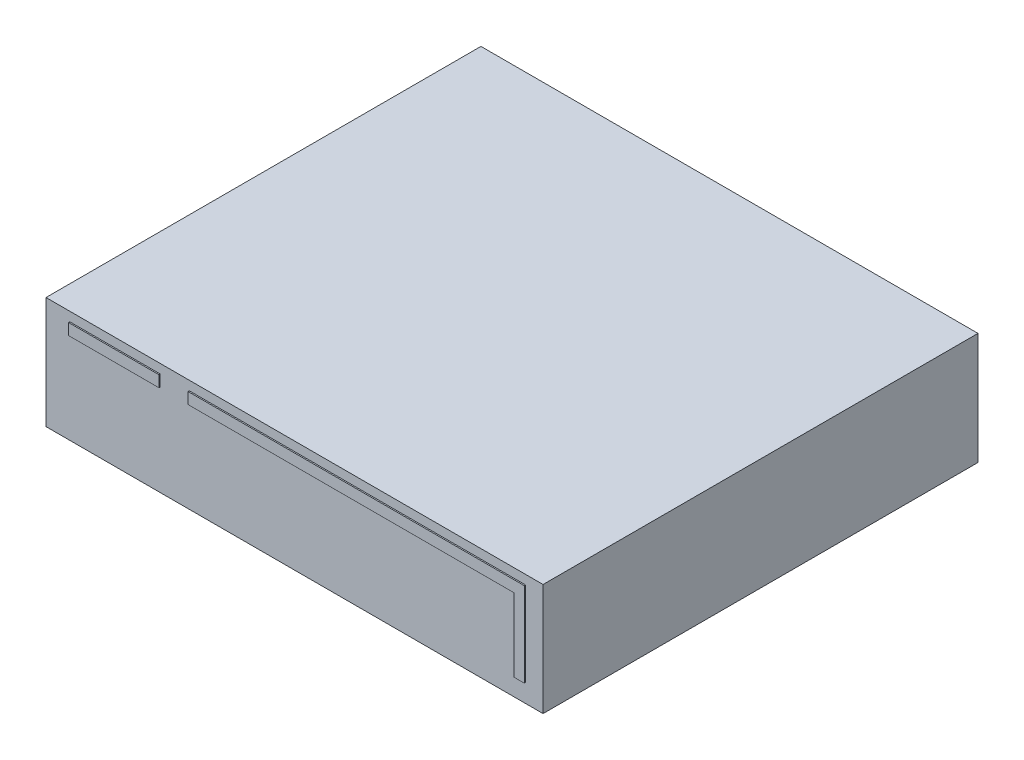
ISO-10303-21;
HEADER;
FILE_DESCRIPTION(('STEP AP214'),'2;1');
FILE_NAME('part.step','',(''),(''),'','','');
FILE_SCHEMA(('AUTOMOTIVE_DESIGN { 1 0 10303 214 1 1 1 1 }'));
ENDSEC;
DATA;
#1=APPLICATION_CONTEXT('core data for automotive mechanical design processes');
#2=APPLICATION_PROTOCOL_DEFINITION('international standard','automotive_design',2000,#1);
#3=PRODUCT_CONTEXT('',#1,'mechanical');
#4=PRODUCT('Part','Part','',(#3));
#5=PRODUCT_RELATED_PRODUCT_CATEGORY('part','',(#4));
#6=PRODUCT_DEFINITION_FORMATION('','',#4);
#7=PRODUCT_DEFINITION_CONTEXT('part definition',#1,'design');
#8=PRODUCT_DEFINITION('design','',#6,#7);
#9=PRODUCT_DEFINITION_SHAPE('','',#8);
#10=(LENGTH_UNIT() NAMED_UNIT(*) SI_UNIT(.MILLI.,.METRE.));
#11=(NAMED_UNIT(*) PLANE_ANGLE_UNIT() SI_UNIT($,.RADIAN.));
#12=(NAMED_UNIT(*) SI_UNIT($,.STERADIAN.) SOLID_ANGLE_UNIT());
#13=UNCERTAINTY_MEASURE_WITH_UNIT(LENGTH_MEASURE(1.E-05),#10,'distance_accuracy_value','');
#14=(GEOMETRIC_REPRESENTATION_CONTEXT(3) GLOBAL_UNCERTAINTY_ASSIGNED_CONTEXT((#13)) GLOBAL_UNIT_ASSIGNED_CONTEXT((#10,
#11,#12)) REPRESENTATION_CONTEXT('',''));
#15=CARTESIAN_POINT('',(0.,0.,0.));
#16=DIRECTION('',(0.,0.,1.));
#17=DIRECTION('',(1.,0.,0.));
#18=AXIS2_PLACEMENT_3D('',#15,#16,#17);
#19=CARTESIAN_POINT('',(0.,0.,0.));
#20=DIRECTION('',(0.,0.,1.));
#21=DIRECTION('',(1.,0.,0.));
#22=AXIS2_PLACEMENT_3D('',#19,#20,#21);
#23=PLANE('',#22);
#24=DIRECTION('',(0.,1.,0.));
#25=VECTOR('',#24,1.);
#26=CARTESIAN_POINT('',(200.,45.,0.));
#27=LINE('',#26,#25);
#28=CARTESIAN_POINT('',(200.,-45.,0.));
#29=VERTEX_POINT('',#28);
#30=CARTESIAN_POINT('',(200.,45.,0.));
#31=VERTEX_POINT('',#30);
#32=EDGE_CURVE('E195',#29,#31,#27,.T.);
#33=ORIENTED_EDGE('',*,*,#32,.T.);
#34=DIRECTION('',(-1.,0.,0.));
#35=VECTOR('',#34,1.);
#36=CARTESIAN_POINT('',(-200.,45.,0.));
#37=LINE('',#36,#35);
#38=CARTESIAN_POINT('',(-200.,45.,0.));
#39=VERTEX_POINT('',#38);
#40=EDGE_CURVE('E211',#31,#39,#37,.T.);
#41=ORIENTED_EDGE('',*,*,#40,.T.);
#42=DIRECTION('',(0.,-1.,0.));
#43=VECTOR('',#42,1.);
#44=CARTESIAN_POINT('',(-200.,45.,0.));
#45=LINE('',#44,#43);
#46=CARTESIAN_POINT('',(-200.,-45.,0.));
#47=VERTEX_POINT('',#46);
#48=EDGE_CURVE('E214',#39,#47,#45,.T.);
#49=ORIENTED_EDGE('',*,*,#48,.T.);
#50=DIRECTION('',(1.,0.,0.));
#51=VECTOR('',#50,1.);
#52=CARTESIAN_POINT('',(-200.,-45.,0.));
#53=LINE('',#52,#51);
#54=EDGE_CURVE('E200',#47,#29,#53,.T.);
#55=ORIENTED_EDGE('',*,*,#54,.T.);
#56=EDGE_LOOP('',(#33,#41,#49,#55));
#57=FACE_BOUND('',#56,.T.);
#58=DIRECTION('',(1.,0.,0.));
#59=VECTOR('',#58,1.);
#60=CARTESIAN_POINT('',(-180.773885729077,28.5432451151186,0.));
#61=LINE('',#60,#59);
#62=CARTESIAN_POINT('',(-180.773885729077,28.5432451151186,0.));
#63=VERTEX_POINT('',#62);
#64=CARTESIAN_POINT('',(-108.118352708778,28.5432451151186,0.));
#65=VERTEX_POINT('',#64);
#66=EDGE_CURVE('E166',#63,#65,#61,.T.);
#67=ORIENTED_EDGE('',*,*,#66,.F.);
#68=DIRECTION('',(0.,-1.,0.));
#69=VECTOR('',#68,1.);
#70=CARTESIAN_POINT('',(-180.773885729077,37.6251867426559,0.));
#71=LINE('',#70,#69);
#72=CARTESIAN_POINT('',(-180.773885729077,37.6251867426559,0.));
#73=VERTEX_POINT('',#72);
#74=EDGE_CURVE('E163',#73,#63,#71,.T.);
#75=ORIENTED_EDGE('',*,*,#74,.F.);
#76=DIRECTION('',(-1.,0.,0.));
#77=VECTOR('',#76,1.);
#78=CARTESIAN_POINT('',(-180.773885729077,37.6251867426559,0.));
#79=LINE('',#78,#77);
#80=CARTESIAN_POINT('',(-108.118352708778,37.6251867426559,0.));
#81=VERTEX_POINT('',#80);
#82=EDGE_CURVE('E176',#81,#73,#79,.T.);
#83=ORIENTED_EDGE('',*,*,#82,.F.);
#84=DIRECTION('',(0.,1.,0.));
#85=VECTOR('',#84,1.);
#86=CARTESIAN_POINT('',(-108.118352708778,37.6251867426559,0.));
#87=LINE('',#86,#85);
#88=EDGE_CURVE('E184',#65,#81,#87,.T.);
#89=ORIENTED_EDGE('',*,*,#88,.F.);
#90=EDGE_LOOP('',(#67,#75,#83,#89));
#91=FACE_BOUND('',#90,.T.);
#92=DIRECTION('',(1.,0.,0.));
#93=VECTOR('',#92,1.);
#94=CARTESIAN_POINT('',(-84.764788523682,28.5432451151186,0.));
#95=LINE('',#94,#93);
#96=CARTESIAN_POINT('',(-84.764788523682,28.5432451151186,0.));
#97=VERTEX_POINT('',#96);
#98=CARTESIAN_POINT('',(177.503334609957,28.5432451151186,0.));
#99=VERTEX_POINT('',#98);
#100=EDGE_CURVE('E420',#97,#99,#95,.T.);
#101=ORIENTED_EDGE('',*,*,#100,.F.);
#102=DIRECTION('',(0.,-1.,0.));
#103=VECTOR('',#102,1.);
#104=CARTESIAN_POINT('',(-84.764788523682,37.6251867426559,0.));
#105=LINE('',#104,#103);
#106=CARTESIAN_POINT('',(-84.764788523682,37.6251867426559,0.));
#107=VERTEX_POINT('',#106);
#108=EDGE_CURVE('E161',#107,#97,#105,.T.);
#109=ORIENTED_EDGE('',*,*,#108,.F.);
#110=DIRECTION('',(-1.,0.,0.));
#111=VECTOR('',#110,1.);
#112=CARTESIAN_POINT('',(-84.764788523682,37.6251867426559,0.));
#113=LINE('',#112,#111);
#114=CARTESIAN_POINT('',(185.963566659099,37.6251867426559,0.));
#115=VERTEX_POINT('',#114);
#116=EDGE_CURVE('E157',#115,#107,#113,.T.);
#117=ORIENTED_EDGE('',*,*,#116,.F.);
#118=DIRECTION('',(0.,1.,0.));
#119=VECTOR('',#118,1.);
#120=CARTESIAN_POINT('',(185.963566659099,37.6251867426559,0.));
#121=LINE('',#120,#119);
#122=CARTESIAN_POINT('',(185.963566659099,-30.3334682121856,0.));
#123=VERTEX_POINT('',#122);
#124=EDGE_CURVE('E416',#123,#115,#121,.T.);
#125=ORIENTED_EDGE('',*,*,#124,.F.);
#126=DIRECTION('',(1.,0.,0.));
#127=VECTOR('',#126,1.);
#128=CARTESIAN_POINT('',(185.963566659099,-30.3334682121856,0.));
#129=LINE('',#128,#127);
#130=CARTESIAN_POINT('',(177.503334609957,-30.3334682121856,0.));
#131=VERTEX_POINT('',#130);
#132=EDGE_CURVE('E428',#131,#123,#129,.T.);
#133=ORIENTED_EDGE('',*,*,#132,.F.);
#134=DIRECTION('',(0.,-1.,0.));
#135=VECTOR('',#134,1.);
#136=CARTESIAN_POINT('',(177.503334609957,28.5432451151186,0.));
#137=LINE('',#136,#135);
#138=EDGE_CURVE('E422',#99,#131,#137,.T.);
#139=ORIENTED_EDGE('',*,*,#138,.F.);
#140=EDGE_LOOP('',(#101,#109,#117,#125,#133,#139));
#141=FACE_BOUND('',#140,.T.);
#142=ADVANCED_FACE('F35',(#57,#91,#141),#23,.T.);
#143=CARTESIAN_POINT('',(200.,45.,-350.));
#144=DIRECTION('',(1.,0.,0.));
#145=DIRECTION('',(0.,0.,-1.));
#146=AXIS2_PLACEMENT_3D('',#143,#144,#145);
#147=PLANE('',#146);
#148=ORIENTED_EDGE('',*,*,#32,.F.);
#149=DIRECTION('',(0.,0.,1.));
#150=VECTOR('',#149,1.);
#151=CARTESIAN_POINT('',(200.,-45.,-350.));
#152=LINE('',#151,#150);
#153=CARTESIAN_POINT('',(200.,-45.,-350.));
#154=VERTEX_POINT('',#153);
#155=EDGE_CURVE('E11',#154,#29,#152,.T.);
#156=ORIENTED_EDGE('',*,*,#155,.F.);
#157=DIRECTION('',(0.,1.,0.));
#158=VECTOR('',#157,1.);
#159=CARTESIAN_POINT('',(200.,45.,-350.));
#160=LINE('',#159,#158);
#161=CARTESIAN_POINT('',(200.,45.,-350.));
#162=VERTEX_POINT('',#161);
#163=EDGE_CURVE('E196',#154,#162,#160,.T.);
#164=ORIENTED_EDGE('',*,*,#163,.T.);
#165=DIRECTION('',(0.,0.,1.));
#166=VECTOR('',#165,1.);
#167=CARTESIAN_POINT('',(200.,45.,-350.));
#168=LINE('',#167,#166);
#169=EDGE_CURVE('E39',#162,#31,#168,.T.);
#170=ORIENTED_EDGE('',*,*,#169,.T.);
#171=EDGE_LOOP('',(#148,#156,#164,#170));
#172=FACE_BOUND('',#171,.T.);
#173=ADVANCED_FACE('F37',(#172),#147,.T.);
#174=CARTESIAN_POINT('',(-200.,-45.,-350.));
#175=DIRECTION('',(0.,-1.,0.));
#176=DIRECTION('',(0.,0.,-1.));
#177=AXIS2_PLACEMENT_3D('',#174,#175,#176);
#178=PLANE('',#177);
#179=ORIENTED_EDGE('',*,*,#54,.F.);
#180=DIRECTION('',(0.,0.,1.));
#181=VECTOR('',#180,1.);
#182=CARTESIAN_POINT('',(-200.,-45.,-350.));
#183=LINE('',#182,#181);
#184=CARTESIAN_POINT('',(-200.,-45.,-350.));
#185=VERTEX_POINT('',#184);
#186=EDGE_CURVE('E44',#185,#47,#183,.T.);
#187=ORIENTED_EDGE('',*,*,#186,.F.);
#188=DIRECTION('',(1.,0.,0.));
#189=VECTOR('',#188,1.);
#190=CARTESIAN_POINT('',(-200.,-45.,-350.));
#191=LINE('',#190,#189);
#192=EDGE_CURVE('E206',#185,#154,#191,.T.);
#193=ORIENTED_EDGE('',*,*,#192,.T.);
#194=ORIENTED_EDGE('',*,*,#155,.T.);
#195=EDGE_LOOP('',(#179,#187,#193,#194));
#196=FACE_BOUND('',#195,.T.);
#197=ADVANCED_FACE('F232',(#196),#178,.T.);
#198=CARTESIAN_POINT('',(-200.,45.,-350.));
#199=DIRECTION('',(-1.,0.,0.));
#200=DIRECTION('',(0.,0.,1.));
#201=AXIS2_PLACEMENT_3D('',#198,#199,#200);
#202=PLANE('',#201);
#203=ORIENTED_EDGE('',*,*,#48,.F.);
#204=DIRECTION('',(0.,0.,1.));
#205=VECTOR('',#204,1.);
#206=CARTESIAN_POINT('',(-200.,45.,-350.));
#207=LINE('',#206,#205);
#208=CARTESIAN_POINT('',(-200.,45.,-350.));
#209=VERTEX_POINT('',#208);
#210=EDGE_CURVE('E219',#209,#39,#207,.T.);
#211=ORIENTED_EDGE('',*,*,#210,.F.);
#212=DIRECTION('',(0.,-1.,0.));
#213=VECTOR('',#212,1.);
#214=CARTESIAN_POINT('',(-200.,45.,-350.));
#215=LINE('',#214,#213);
#216=EDGE_CURVE('E203',#209,#185,#215,.T.);
#217=ORIENTED_EDGE('',*,*,#216,.T.);
#218=ORIENTED_EDGE('',*,*,#186,.T.);
#219=EDGE_LOOP('',(#203,#211,#217,#218));
#220=FACE_BOUND('',#219,.T.);
#221=ADVANCED_FACE('F238',(#220),#202,.T.);
#222=CARTESIAN_POINT('',(-200.,45.,-350.));
#223=DIRECTION('',(0.,1.,0.));
#224=DIRECTION('',(0.,0.,1.));
#225=AXIS2_PLACEMENT_3D('',#222,#223,#224);
#226=PLANE('',#225);
#227=ORIENTED_EDGE('',*,*,#40,.F.);
#228=ORIENTED_EDGE('',*,*,#169,.F.);
#229=DIRECTION('',(-1.,0.,0.));
#230=VECTOR('',#229,1.);
#231=CARTESIAN_POINT('',(-200.,45.,-350.));
#232=LINE('',#231,#230);
#233=EDGE_CURVE('E199',#162,#209,#232,.T.);
#234=ORIENTED_EDGE('',*,*,#233,.T.);
#235=ORIENTED_EDGE('',*,*,#210,.T.);
#236=EDGE_LOOP('',(#227,#228,#234,#235));
#237=FACE_BOUND('',#236,.T.);
#238=ADVANCED_FACE('F227',(#237),#226,.T.);
#239=CARTESIAN_POINT('',(0.,0.,-350.));
#240=DIRECTION('',(0.,0.,1.));
#241=DIRECTION('',(1.,0.,0.));
#242=AXIS2_PLACEMENT_3D('',#239,#240,#241);
#243=PLANE('',#242);
#244=ORIENTED_EDGE('',*,*,#163,.F.);
#245=ORIENTED_EDGE('',*,*,#192,.F.);
#246=ORIENTED_EDGE('',*,*,#216,.F.);
#247=ORIENTED_EDGE('',*,*,#233,.F.);
#248=EDGE_LOOP('',(#244,#245,#246,#247));
#249=FACE_BOUND('',#248,.T.);
#250=ADVANCED_FACE('F235',(#249),#243,.F.);
#251=CARTESIAN_POINT('',(-180.773885729077,37.6251867426559,1.));
#252=DIRECTION('',(1.,0.,0.));
#253=DIRECTION('',(0.,0.,-1.));
#254=AXIS2_PLACEMENT_3D('',#251,#252,#253);
#255=PLANE('',#254);
#256=ORIENTED_EDGE('',*,*,#74,.T.);
#257=DIRECTION('',(0.,0.,-1.));
#258=VECTOR('',#257,1.);
#259=CARTESIAN_POINT('',(-180.773885729077,28.5432451151186,1.));
#260=LINE('',#259,#258);
#261=CARTESIAN_POINT('',(-180.773885729077,28.5432451151186,1.));
#262=VERTEX_POINT('',#261);
#263=EDGE_CURVE('E193',#262,#63,#260,.T.);
#264=ORIENTED_EDGE('',*,*,#263,.F.);
#265=DIRECTION('',(0.,-1.,0.));
#266=VECTOR('',#265,1.);
#267=CARTESIAN_POINT('',(-180.773885729077,37.6251867426559,1.));
#268=LINE('',#267,#266);
#269=CARTESIAN_POINT('',(-180.773885729077,37.6251867426559,1.));
#270=VERTEX_POINT('',#269);
#271=EDGE_CURVE('E172',#270,#262,#268,.T.);
#272=ORIENTED_EDGE('',*,*,#271,.F.);
#273=DIRECTION('',(0.,0.,-1.));
#274=VECTOR('',#273,1.);
#275=CARTESIAN_POINT('',(-180.773885729077,37.6251867426559,1.));
#276=LINE('',#275,#274);
#277=EDGE_CURVE('E181',#270,#73,#276,.T.);
#278=ORIENTED_EDGE('',*,*,#277,.T.);
#279=EDGE_LOOP('',(#256,#264,#272,#278));
#280=FACE_BOUND('',#279,.T.);
#281=ADVANCED_FACE('F254',(#280),#255,.F.);
#282=CARTESIAN_POINT('',(-180.773885729077,28.5432451151186,1.));
#283=DIRECTION('',(0.,1.,0.));
#284=DIRECTION('',(0.,0.,1.));
#285=AXIS2_PLACEMENT_3D('',#282,#283,#284);
#286=PLANE('',#285);
#287=ORIENTED_EDGE('',*,*,#66,.T.);
#288=DIRECTION('',(0.,0.,-1.));
#289=VECTOR('',#288,1.);
#290=CARTESIAN_POINT('',(-108.118352708778,28.5432451151186,1.));
#291=LINE('',#290,#289);
#292=CARTESIAN_POINT('',(-108.118352708778,28.5432451151186,1.));
#293=VERTEX_POINT('',#292);
#294=EDGE_CURVE('E190',#293,#65,#291,.T.);
#295=ORIENTED_EDGE('',*,*,#294,.F.);
#296=DIRECTION('',(1.,0.,0.));
#297=VECTOR('',#296,1.);
#298=CARTESIAN_POINT('',(-180.773885729077,28.5432451151186,1.));
#299=LINE('',#298,#297);
#300=EDGE_CURVE('E175',#262,#293,#299,.T.);
#301=ORIENTED_EDGE('',*,*,#300,.F.);
#302=ORIENTED_EDGE('',*,*,#263,.T.);
#303=EDGE_LOOP('',(#287,#295,#301,#302));
#304=FACE_BOUND('',#303,.T.);
#305=ADVANCED_FACE('F257',(#304),#286,.F.);
#306=CARTESIAN_POINT('',(-108.118352708778,37.6251867426559,1.));
#307=DIRECTION('',(-1.,0.,0.));
#308=DIRECTION('',(0.,0.,1.));
#309=AXIS2_PLACEMENT_3D('',#306,#307,#308);
#310=PLANE('',#309);
#311=ORIENTED_EDGE('',*,*,#88,.T.);
#312=DIRECTION('',(0.,0.,-1.));
#313=VECTOR('',#312,1.);
#314=CARTESIAN_POINT('',(-108.118352708778,37.6251867426559,1.));
#315=LINE('',#314,#313);
#316=CARTESIAN_POINT('',(-108.118352708778,37.6251867426559,1.));
#317=VERTEX_POINT('',#316);
#318=EDGE_CURVE('E60',#317,#81,#315,.T.);
#319=ORIENTED_EDGE('',*,*,#318,.F.);
#320=DIRECTION('',(0.,1.,0.));
#321=VECTOR('',#320,1.);
#322=CARTESIAN_POINT('',(-108.118352708778,37.6251867426559,1.));
#323=LINE('',#322,#321);
#324=EDGE_CURVE('E178',#293,#317,#323,.T.);
#325=ORIENTED_EDGE('',*,*,#324,.F.);
#326=ORIENTED_EDGE('',*,*,#294,.T.);
#327=EDGE_LOOP('',(#311,#319,#325,#326));
#328=FACE_BOUND('',#327,.T.);
#329=ADVANCED_FACE('F261',(#328),#310,.F.);
#330=CARTESIAN_POINT('',(-180.773885729077,37.6251867426559,1.));
#331=DIRECTION('',(0.,-1.,0.));
#332=DIRECTION('',(0.,0.,-1.));
#333=AXIS2_PLACEMENT_3D('',#330,#331,#332);
#334=PLANE('',#333);
#335=ORIENTED_EDGE('',*,*,#82,.T.);
#336=ORIENTED_EDGE('',*,*,#277,.F.);
#337=DIRECTION('',(-1.,0.,0.));
#338=VECTOR('',#337,1.);
#339=CARTESIAN_POINT('',(-180.773885729077,37.6251867426559,1.));
#340=LINE('',#339,#338);
#341=EDGE_CURVE('E180',#317,#270,#340,.T.);
#342=ORIENTED_EDGE('',*,*,#341,.F.);
#343=ORIENTED_EDGE('',*,*,#318,.T.);
#344=EDGE_LOOP('',(#335,#336,#342,#343));
#345=FACE_BOUND('',#344,.T.);
#346=ADVANCED_FACE('F265',(#345),#334,.F.);
#347=CARTESIAN_POINT('',(0.,0.,1.));
#348=DIRECTION('',(0.,0.,1.));
#349=DIRECTION('',(1.,0.,0.));
#350=AXIS2_PLACEMENT_3D('',#347,#348,#349);
#351=PLANE('',#350);
#352=ORIENTED_EDGE('',*,*,#271,.T.);
#353=ORIENTED_EDGE('',*,*,#300,.T.);
#354=ORIENTED_EDGE('',*,*,#324,.T.);
#355=ORIENTED_EDGE('',*,*,#341,.T.);
#356=EDGE_LOOP('',(#352,#353,#354,#355));
#357=FACE_BOUND('',#356,.T.);
#358=ADVANCED_FACE('F269',(#357),#351,.T.);
#359=CARTESIAN_POINT('',(-84.764788523682,37.6251867426559,1.));
#360=DIRECTION('',(1.,0.,0.));
#361=DIRECTION('',(0.,0.,-1.));
#362=AXIS2_PLACEMENT_3D('',#359,#360,#361);
#363=PLANE('',#362);
#364=ORIENTED_EDGE('',*,*,#108,.T.);
#365=DIRECTION('',(0.,0.,-1.));
#366=VECTOR('',#365,1.);
#367=CARTESIAN_POINT('',(-84.764788523682,28.5432451151186,1.));
#368=LINE('',#367,#366);
#369=CARTESIAN_POINT('',(-84.764788523682,28.5432451151186,1.));
#370=VERTEX_POINT('',#369);
#371=EDGE_CURVE('E142',#370,#97,#368,.T.);
#372=ORIENTED_EDGE('',*,*,#371,.F.);
#373=DIRECTION('',(0.,-1.,0.));
#374=VECTOR('',#373,1.);
#375=CARTESIAN_POINT('',(-84.764788523682,37.6251867426559,1.));
#376=LINE('',#375,#374);
#377=CARTESIAN_POINT('',(-84.764788523682,37.6251867426559,1.));
#378=VERTEX_POINT('',#377);
#379=EDGE_CURVE('E149',#378,#370,#376,.T.);
#380=ORIENTED_EDGE('',*,*,#379,.F.);
#381=DIRECTION('',(0.,0.,-1.));
#382=VECTOR('',#381,1.);
#383=CARTESIAN_POINT('',(-84.764788523682,37.6251867426559,1.));
#384=LINE('',#383,#382);
#385=EDGE_CURVE('E413',#378,#107,#384,.T.);
#386=ORIENTED_EDGE('',*,*,#385,.T.);
#387=EDGE_LOOP('',(#364,#372,#380,#386));
#388=FACE_BOUND('',#387,.T.);
#389=ADVANCED_FACE('F159',(#388),#363,.F.);
#390=CARTESIAN_POINT('',(-84.764788523682,28.5432451151186,1.));
#391=DIRECTION('',(0.,1.,0.));
#392=DIRECTION('',(0.,0.,1.));
#393=AXIS2_PLACEMENT_3D('',#390,#391,#392);
#394=PLANE('',#393);
#395=ORIENTED_EDGE('',*,*,#100,.T.);
#396=DIRECTION('',(0.,0.,-1.));
#397=VECTOR('',#396,1.);
#398=CARTESIAN_POINT('',(177.503334609957,28.5432451151186,1.));
#399=LINE('',#398,#397);
#400=CARTESIAN_POINT('',(177.503334609957,28.5432451151186,1.));
#401=VERTEX_POINT('',#400);
#402=EDGE_CURVE('E145',#401,#99,#399,.T.);
#403=ORIENTED_EDGE('',*,*,#402,.F.);
#404=DIRECTION('',(1.,0.,0.));
#405=VECTOR('',#404,1.);
#406=CARTESIAN_POINT('',(-84.764788523682,28.5432451151186,1.));
#407=LINE('',#406,#405);
#408=EDGE_CURVE('E138',#370,#401,#407,.T.);
#409=ORIENTED_EDGE('',*,*,#408,.F.);
#410=ORIENTED_EDGE('',*,*,#371,.T.);
#411=EDGE_LOOP('',(#395,#403,#409,#410));
#412=FACE_BOUND('',#411,.T.);
#413=ADVANCED_FACE('F140',(#412),#394,.F.);
#414=CARTESIAN_POINT('',(177.503334609957,28.5432451151186,1.));
#415=DIRECTION('',(1.,0.,0.));
#416=DIRECTION('',(0.,0.,-1.));
#417=AXIS2_PLACEMENT_3D('',#414,#415,#416);
#418=PLANE('',#417);
#419=ORIENTED_EDGE('',*,*,#138,.T.);
#420=DIRECTION('',(0.,0.,-1.));
#421=VECTOR('',#420,1.);
#422=CARTESIAN_POINT('',(177.503334609957,-30.3334682121856,1.));
#423=LINE('',#422,#421);
#424=CARTESIAN_POINT('',(177.503334609957,-30.3334682121856,1.));
#425=VERTEX_POINT('',#424);
#426=EDGE_CURVE('E168',#425,#131,#423,.T.);
#427=ORIENTED_EDGE('',*,*,#426,.F.);
#428=DIRECTION('',(0.,-1.,0.));
#429=VECTOR('',#428,1.);
#430=CARTESIAN_POINT('',(177.503334609957,28.5432451151186,1.));
#431=LINE('',#430,#429);
#432=EDGE_CURVE('E148',#401,#425,#431,.T.);
#433=ORIENTED_EDGE('',*,*,#432,.F.);
#434=ORIENTED_EDGE('',*,*,#402,.T.);
#435=EDGE_LOOP('',(#419,#427,#433,#434));
#436=FACE_BOUND('',#435,.T.);
#437=ADVANCED_FACE('F277',(#436),#418,.F.);
#438=CARTESIAN_POINT('',(185.963566659099,-30.3334682121856,1.));
#439=DIRECTION('',(0.,1.,0.));
#440=DIRECTION('',(0.,0.,1.));
#441=AXIS2_PLACEMENT_3D('',#438,#439,#440);
#442=PLANE('',#441);
#443=ORIENTED_EDGE('',*,*,#132,.T.);
#444=DIRECTION('',(0.,0.,-1.));
#445=VECTOR('',#444,1.);
#446=CARTESIAN_POINT('',(185.963566659099,-30.3334682121856,1.));
#447=LINE('',#446,#445);
#448=CARTESIAN_POINT('',(185.963566659099,-30.3334682121856,1.));
#449=VERTEX_POINT('',#448);
#450=EDGE_CURVE('E432',#449,#123,#447,.T.);
#451=ORIENTED_EDGE('',*,*,#450,.F.);
#452=DIRECTION('',(1.,0.,0.));
#453=VECTOR('',#452,1.);
#454=CARTESIAN_POINT('',(185.963566659099,-30.3334682121856,1.));
#455=LINE('',#454,#453);
#456=EDGE_CURVE('E439',#425,#449,#455,.T.);
#457=ORIENTED_EDGE('',*,*,#456,.F.);
#458=ORIENTED_EDGE('',*,*,#426,.T.);
#459=EDGE_LOOP('',(#443,#451,#457,#458));
#460=FACE_BOUND('',#459,.T.);
#461=ADVANCED_FACE('F280',(#460),#442,.F.);
#462=CARTESIAN_POINT('',(185.963566659099,37.6251867426559,1.));
#463=DIRECTION('',(-1.,0.,0.));
#464=DIRECTION('',(0.,0.,1.));
#465=AXIS2_PLACEMENT_3D('',#462,#463,#464);
#466=PLANE('',#465);
#467=ORIENTED_EDGE('',*,*,#124,.T.);
#468=DIRECTION('',(0.,0.,-1.));
#469=VECTOR('',#468,1.);
#470=CARTESIAN_POINT('',(185.963566659099,37.6251867426559,1.));
#471=LINE('',#470,#469);
#472=CARTESIAN_POINT('',(185.963566659099,37.6251867426559,1.));
#473=VERTEX_POINT('',#472);
#474=EDGE_CURVE('E52',#473,#115,#471,.T.);
#475=ORIENTED_EDGE('',*,*,#474,.F.);
#476=DIRECTION('',(0.,1.,0.));
#477=VECTOR('',#476,1.);
#478=CARTESIAN_POINT('',(185.963566659099,28.5432451151186,1.));
#479=LINE('',#478,#477);
#480=EDGE_CURVE('E441',#449,#473,#479,.T.);
#481=ORIENTED_EDGE('',*,*,#480,.F.);
#482=ORIENTED_EDGE('',*,*,#450,.T.);
#483=EDGE_LOOP('',(#467,#475,#481,#482));
#484=FACE_BOUND('',#483,.T.);
#485=ADVANCED_FACE('F284',(#484),#466,.F.);
#486=CARTESIAN_POINT('',(-84.764788523682,37.6251867426559,1.));
#487=DIRECTION('',(0.,-1.,0.));
#488=DIRECTION('',(0.,0.,-1.));
#489=AXIS2_PLACEMENT_3D('',#486,#487,#488);
#490=PLANE('',#489);
#491=ORIENTED_EDGE('',*,*,#116,.T.);
#492=ORIENTED_EDGE('',*,*,#385,.F.);
#493=DIRECTION('',(-1.,0.,0.));
#494=VECTOR('',#493,1.);
#495=CARTESIAN_POINT('',(-84.764788523682,37.6251867426559,1.));
#496=LINE('',#495,#494);
#497=EDGE_CURVE('E153',#473,#378,#496,.T.);
#498=ORIENTED_EDGE('',*,*,#497,.F.);
#499=ORIENTED_EDGE('',*,*,#474,.T.);
#500=EDGE_LOOP('',(#491,#492,#498,#499));
#501=FACE_BOUND('',#500,.T.);
#502=ADVANCED_FACE('F288',(#501),#490,.F.);
#503=CARTESIAN_POINT('',(0.,0.,1.));
#504=DIRECTION('',(0.,0.,1.));
#505=DIRECTION('',(1.,0.,0.));
#506=AXIS2_PLACEMENT_3D('',#503,#504,#505);
#507=PLANE('',#506);
#508=ORIENTED_EDGE('',*,*,#379,.T.);
#509=ORIENTED_EDGE('',*,*,#408,.T.);
#510=ORIENTED_EDGE('',*,*,#432,.T.);
#511=ORIENTED_EDGE('',*,*,#456,.T.);
#512=ORIENTED_EDGE('',*,*,#480,.T.);
#513=ORIENTED_EDGE('',*,*,#497,.T.);
#514=EDGE_LOOP('',(#508,#509,#510,#511,#512,#513));
#515=FACE_BOUND('',#514,.T.);
#516=ADVANCED_FACE('F152',(#515),#507,.T.);
#517=CLOSED_SHELL('',(#142,#173,#197,#221,#238,#250,#281,#305,#329,#346,#358,#389,#413,#437,
#461,#485,#502,#516));
#518=MANIFOLD_SOLID_BREP('B2',#517);
#519=ADVANCED_BREP_SHAPE_REPRESENTATION('',(#18,#518),#14);
#520=SHAPE_DEFINITION_REPRESENTATION(#9,#519);
ENDSEC;
END-ISO-10303-21;
